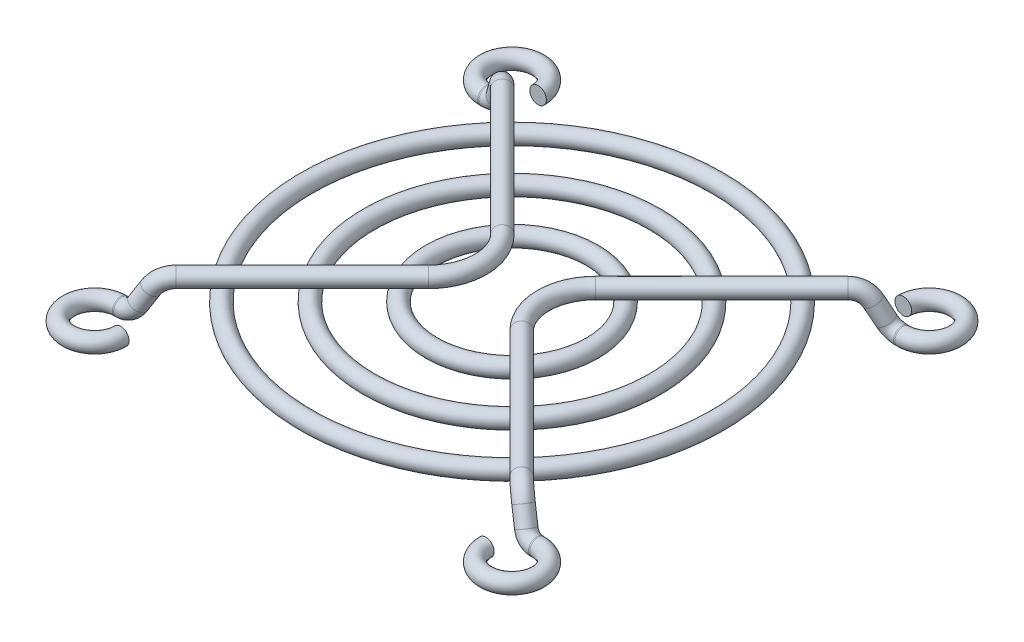
ISO-10303-21;
HEADER;
FILE_DESCRIPTION(('STEP AP214'),'2;1');
FILE_NAME('part.step','',(''),(''),'','','');
FILE_SCHEMA(('AUTOMOTIVE_DESIGN { 1 0 10303 214 1 1 1 1 }'));
ENDSEC;
DATA;
#1=APPLICATION_CONTEXT('core data for automotive mechanical design processes');
#2=APPLICATION_PROTOCOL_DEFINITION('international standard','automotive_design',2000,#1);
#3=PRODUCT_CONTEXT('',#1,'mechanical');
#4=PRODUCT('Part','Part','',(#3));
#5=PRODUCT_RELATED_PRODUCT_CATEGORY('part','',(#4));
#6=PRODUCT_DEFINITION_FORMATION('','',#4);
#7=PRODUCT_DEFINITION_CONTEXT('part definition',#1,'design');
#8=PRODUCT_DEFINITION('design','',#6,#7);
#9=PRODUCT_DEFINITION_SHAPE('','',#8);
#10=(LENGTH_UNIT() NAMED_UNIT(*) SI_UNIT(.MILLI.,.METRE.));
#11=(NAMED_UNIT(*) PLANE_ANGLE_UNIT() SI_UNIT($,.RADIAN.));
#12=(NAMED_UNIT(*) SI_UNIT($,.STERADIAN.) SOLID_ANGLE_UNIT());
#13=UNCERTAINTY_MEASURE_WITH_UNIT(LENGTH_MEASURE(1.E-05),#10,'distance_accuracy_value','');
#14=(GEOMETRIC_REPRESENTATION_CONTEXT(3) GLOBAL_UNCERTAINTY_ASSIGNED_CONTEXT((#13)) GLOBAL_UNIT_ASSIGNED_CONTEXT((#10,
#11,#12)) REPRESENTATION_CONTEXT('',''));
#15=CARTESIAN_POINT('',(0.,0.,0.));
#16=DIRECTION('',(0.,0.,1.));
#17=DIRECTION('',(1.,0.,0.));
#18=AXIS2_PLACEMENT_3D('',#15,#16,#17);
#19=CARTESIAN_POINT('',(20.,-1.6,-20.));
#20=DIRECTION('',(0.,-1.,0.));
#21=DIRECTION('',(0.,0.,-1.));
#22=AXIS2_PLACEMENT_3D('',#19,#20,#21);
#23=TOROIDAL_SURFACE('',#22,2.5,0.799999999999999);
#24=CARTESIAN_POINT('',(17.5,-1.6,-19.9999999999999));
#25=DIRECTION('',(0.,0.,-1.));
#26=DIRECTION('',(-1.,0.,0.));
#27=AXIS2_PLACEMENT_3D('',#24,#25,#26);
#28=CIRCLE('',#27,0.799999999999999);
#29=CARTESIAN_POINT('',(16.7,-1.6,-19.9999999999999));
#30=VERTEX_POINT('',#29);
#31=EDGE_CURVE('E11',#30,#30,#28,.T.);
#32=CARTESIAN_POINT('',(20.,-1.6,-17.5));
#33=DIRECTION('',(-1.,0.,0.));
#34=DIRECTION('',(0.,0.,1.));
#35=AXIS2_PLACEMENT_3D('',#32,#33,#34);
#36=CIRCLE('',#35,0.799999999999999);
#37=CARTESIAN_POINT('',(20.,-1.6,-16.7));
#38=VERTEX_POINT('',#37);
#39=EDGE_CURVE('E49',#38,#38,#36,.T.);
#40=CARTESIAN_POINT('',(20.,-1.6,-20.));
#41=DIRECTION('',(0.,-1.,0.));
#42=DIRECTION('',(0.,0.,-1.));
#43=AXIS2_PLACEMENT_3D('',#40,#41,#42);
#44=CIRCLE('',#43,3.3);
#45=EDGE_CURVE('',#30,#38,#44,.T.);
#46=ORIENTED_EDGE('',*,*,#31,.T.);
#47=ORIENTED_EDGE('',*,*,#39,.F.);
#48=ORIENTED_EDGE('',*,*,#45,.T.);
#49=ORIENTED_EDGE('',*,*,#45,.F.);
#50=EDGE_LOOP('',(#46,#48,#47,#49));
#51=FACE_BOUND('',#50,.T.);
#52=ADVANCED_FACE('F43',(#51),#23,.T.);
#53=CARTESIAN_POINT('',(19.8782443274925,-1.6,-17.5));
#54=DIRECTION('',(1.,0.,0.));
#55=DIRECTION('',(0.,-1.,0.));
#56=AXIS2_PLACEMENT_3D('',#53,#54,#55);
#57=CYLINDRICAL_SURFACE('',#56,0.799999999999999);
#58=CARTESIAN_POINT('',(19.8782443274925,-1.6,-17.5));
#59=DIRECTION('',(-1.,0.,0.));
#60=DIRECTION('',(0.,0.,1.));
#61=AXIS2_PLACEMENT_3D('',#58,#59,#60);
#62=CIRCLE('',#61,0.799999999999999);
#63=CARTESIAN_POINT('',(19.8782443274926,-2.35955153182213,-17.7511602486594));
#64=VERTEX_POINT('',#63);
#65=EDGE_CURVE('E53',#64,#64,#62,.T.);
#66=ORIENTED_EDGE('',*,*,#65,.F.);
#67=EDGE_LOOP('',(#66));
#68=FACE_BOUND('',#67,.T.);
#69=ORIENTED_EDGE('',*,*,#39,.T.);
#70=EDGE_LOOP('',(#69));
#71=FACE_BOUND('',#70,.T.);
#72=ADVANCED_FACE('F111',(#68,#71),#57,.T.);
#73=CARTESIAN_POINT('',(19.8782443274925,-0.270784819311277,-17.060469564846));
#74=DIRECTION('',(0.,0.313950310824273,-0.949439414777658));
#75=DIRECTION('',(0.,0.949439414777658,0.313950310824273));
#76=AXIS2_PLACEMENT_3D('',#73,#74,#75);
#77=TOROIDAL_SURFACE('',#76,1.4,0.799999999999999);
#78=CARTESIAN_POINT('',(18.617781817604,-0.849268726889308,-17.2517563386666));
#79=DIRECTION('',(-0.435207117690506,0.854809134098409,0.282658997687056));
#80=DIRECTION('',(0.282658997687037,-0.168351654670456,0.944331303831595));
#81=AXIS2_PLACEMENT_3D('',#78,#79,#80);
#82=CIRCLE('',#81,0.799999999999999);
#83=CARTESIAN_POINT('',(17.8975175262391,-1.17983095979104,-17.3610630665641));
#84=VERTEX_POINT('',#83);
#85=EDGE_CURVE('E57',#84,#84,#82,.T.);
#86=CARTESIAN_POINT('',(19.8782443274925,-0.270784819311277,-17.060469564846));
#87=DIRECTION('',(0.,0.313950310824273,-0.949439414777658));
#88=DIRECTION('',(0.,0.949439414777658,0.313950310824273));
#89=AXIS2_PLACEMENT_3D('',#86,#87,#88);
#90=CIRCLE('',#89,2.2);
#91=EDGE_CURVE('',#64,#84,#90,.T.);
#92=ORIENTED_EDGE('',*,*,#65,.T.);
#93=ORIENTED_EDGE('',*,*,#85,.F.);
#94=ORIENTED_EDGE('',*,*,#91,.T.);
#95=ORIENTED_EDGE('',*,*,#91,.F.);
#96=EDGE_LOOP('',(#92,#94,#93,#95));
#97=FACE_BOUND('',#96,.T.);
#98=ADVANCED_FACE('F116',(#97),#77,.T.);
#99=CARTESIAN_POINT('',(17.868227009508,0.62296430980344,-16.764934312657));
#100=DIRECTION('',(0.435207117690505,-0.854809134098413,-0.282658997687043));
#101=DIRECTION('',(-0.891149813497044,-0.4537091688562,0.));
#102=AXIS2_PLACEMENT_3D('',#99,#100,#101);
#103=CYLINDRICAL_SURFACE('',#102,0.799999999999999);
#104=CARTESIAN_POINT('',(17.868227009508,0.62296430980344,-16.764934312657));
#105=DIRECTION('',(-0.435207117690506,0.854809134098409,0.282658997687056));
#106=DIRECTION('',(0.282658997687037,-0.168351654670456,0.944331303831595));
#107=AXIS2_PLACEMENT_3D('',#104,#105,#106);
#108=CIRCLE('',#107,0.799999999999999);
#109=CARTESIAN_POINT('',(18.3196651347374,1.02585560697571,-17.2882718918086));
#110=VERTEX_POINT('',#109);
#111=EDGE_CURVE('E62',#110,#110,#108,.T.);
#112=ORIENTED_EDGE('',*,*,#111,.F.);
#113=EDGE_LOOP('',(#112));
#114=FACE_BOUND('',#113,.T.);
#115=ORIENTED_EDGE('',*,*,#85,.T.);
#116=EDGE_LOOP('',(#115));
#117=FACE_BOUND('',#116,.T.);
#118=ADVANCED_FACE('F121',(#114,#117),#103,.T.);
#119=CARTESIAN_POINT('',(16.7396316964346,-0.384263933127242,-15.4565903647781));
#120=DIRECTION('',(0.701543241389085,0.125196489258293,0.701543241389078));
#121=DIRECTION('',(-0.707106781186544,0.,0.707106781186551));
#122=AXIS2_PLACEMENT_3D('',#119,#120,#121);
#123=TOROIDAL_SURFACE('',#122,2.,0.799999999999999);
#124=CARTESIAN_POINT('',(16.562577123364,1.6,-15.6336449378487));
#125=DIRECTION('',(-0.707106781186537,0.,0.707106781186558));
#126=DIRECTION('',(0.637166139093871,-0.433634203430094,0.637166139093846));
#127=AXIS2_PLACEMENT_3D('',#124,#125,#126);
#128=CIRCLE('',#127,0.799999999999999);
#129=CARTESIAN_POINT('',(16.4917552941358,2.39370557325089,-15.7044667670769));
#130=VERTEX_POINT('',#129);
#131=EDGE_CURVE('E65',#130,#130,#128,.T.);
#132=CARTESIAN_POINT('',(16.7396316964346,-0.384263933127242,-15.4565903647781));
#133=DIRECTION('',(0.701543241389085,0.125196489258293,0.701543241389078));
#134=DIRECTION('',(-0.707106781186544,0.,0.707106781186551));
#135=AXIS2_PLACEMENT_3D('',#132,#133,#134);
#136=CIRCLE('',#135,2.8);
#137=EDGE_CURVE('',#110,#130,#136,.T.);
#138=ORIENTED_EDGE('',*,*,#111,.T.);
#139=ORIENTED_EDGE('',*,*,#131,.F.);
#140=ORIENTED_EDGE('',*,*,#137,.T.);
#141=ORIENTED_EDGE('',*,*,#137,.F.);
#142=EDGE_LOOP('',(#138,#140,#139,#141));
#143=FACE_BOUND('',#142,.T.);
#144=ADVANCED_FACE('F128',(#143),#123,.T.);
#145=CARTESIAN_POINT('',(4.46446609275775,1.6,-3.53553390724225));
#146=DIRECTION('',(0.707106781186544,0.,-0.707106781186551));
#147=DIRECTION('',(0.707106781186551,0.,0.707106781186544));
#148=AXIS2_PLACEMENT_3D('',#145,#146,#147);
#149=CYLINDRICAL_SURFACE('',#148,0.799999999999999);
#150=CARTESIAN_POINT('',(4.46446609275775,1.6,-3.53553390724225));
#151=DIRECTION('',(-0.707106781186537,0.,0.707106781186558));
#152=DIRECTION('',(0.637166139093871,-0.433634203430094,0.637166139093846));
#153=AXIS2_PLACEMENT_3D('',#150,#151,#152);
#154=CIRCLE('',#153,0.799999999999999);
#155=CARTESIAN_POINT('',(3.89878066780851,1.6,-4.10121933219149));
#156=VERTEX_POINT('',#155);
#157=EDGE_CURVE('E68',#156,#156,#154,.T.);
#158=ORIENTED_EDGE('',*,*,#157,.F.);
#159=EDGE_LOOP('',(#158));
#160=FACE_BOUND('',#159,.T.);
#161=ORIENTED_EDGE('',*,*,#131,.T.);
#162=EDGE_LOOP('',(#161));
#163=FACE_BOUND('',#162,.T.);
#164=ADVANCED_FACE('F132',(#160,#163),#149,.T.);
#165=CARTESIAN_POINT('',(8.,1.6,0.));
#166=DIRECTION('',(0.,1.,0.));
#167=DIRECTION('',(0.,0.,1.));
#168=AXIS2_PLACEMENT_3D('',#165,#166,#167);
#169=TOROIDAL_SURFACE('',#168,5.00000000185193,0.799999999999999);
#170=CARTESIAN_POINT('',(4.46446609275775,1.6,3.53553390724226));
#171=DIRECTION('',(0.70710678118656,0.,0.707106781186535));
#172=DIRECTION('',(0.637166139093845,-0.433634203430094,-0.637166139093872));
#173=AXIS2_PLACEMENT_3D('',#170,#171,#172);
#174=CIRCLE('',#173,0.799999999999999);
#175=CARTESIAN_POINT('',(3.89878066780852,1.6,4.10121933219149));
#176=VERTEX_POINT('',#175);
#177=EDGE_CURVE('E71',#176,#176,#174,.T.);
#178=CARTESIAN_POINT('',(8.,1.6,0.));
#179=DIRECTION('',(0.,1.,0.));
#180=DIRECTION('',(0.,0.,1.));
#181=AXIS2_PLACEMENT_3D('',#178,#179,#180);
#182=CIRCLE('',#181,5.80000000185193);
#183=EDGE_CURVE('',#156,#176,#182,.T.);
#184=ORIENTED_EDGE('',*,*,#157,.T.);
#185=ORIENTED_EDGE('',*,*,#177,.F.);
#186=ORIENTED_EDGE('',*,*,#183,.T.);
#187=ORIENTED_EDGE('',*,*,#183,.F.);
#188=EDGE_LOOP('',(#184,#186,#185,#187));
#189=FACE_BOUND('',#188,.T.);
#190=ADVANCED_FACE('F136',(#189),#169,.T.);
#191=CARTESIAN_POINT('',(16.5625771233642,1.59999999999999,15.6336449378485));
#192=DIRECTION('',(-0.707106781186553,0.,-0.707106781186542));
#193=DIRECTION('',(0.707106781186542,0.,-0.707106781186553));
#194=AXIS2_PLACEMENT_3D('',#191,#192,#193);
#195=CYLINDRICAL_SURFACE('',#194,0.799999999999999);
#196=CARTESIAN_POINT('',(16.5625771233642,1.59999999999999,15.6336449378485));
#197=DIRECTION('',(0.70710678118656,0.,0.707106781186535));
#198=DIRECTION('',(0.637166139093845,-0.433634203430094,-0.637166139093872));
#199=AXIS2_PLACEMENT_3D('',#196,#197,#198);
#200=CIRCLE('',#199,0.799999999999999);
#201=CARTESIAN_POINT('',(16.491755294136,2.3937055732509,15.7044667670767));
#202=VERTEX_POINT('',#201);
#203=EDGE_CURVE('E74',#202,#202,#200,.T.);
#204=ORIENTED_EDGE('',*,*,#203,.F.);
#205=EDGE_LOOP('',(#204));
#206=FACE_BOUND('',#205,.T.);
#207=ORIENTED_EDGE('',*,*,#177,.T.);
#208=EDGE_LOOP('',(#207));
#209=FACE_BOUND('',#208,.T.);
#210=ADVANCED_FACE('F140',(#206,#209),#195,.T.);
#211=CARTESIAN_POINT('',(16.7396316964347,-0.384263933127265,15.4565903647781));
#212=DIRECTION('',(0.701543241389084,0.125196489258209,-0.701543241389094));
#213=DIRECTION('',(0.707106781186553,0.,0.707106781186542));
#214=AXIS2_PLACEMENT_3D('',#211,#212,#213);
#215=TOROIDAL_SURFACE('',#214,1.99999999999999,0.799999999999999);
#216=CARTESIAN_POINT('',(17.8682270095082,0.622964309803452,16.7649343126569));
#217=DIRECTION('',(0.435207117690451,-0.854809134098433,0.282658997687066));
#218=DIRECTION('',(0.282658997687073,-0.168351654670459,-0.944331303831583));
#219=AXIS2_PLACEMENT_3D('',#216,#217,#218);
#220=CIRCLE('',#219,0.799999999999999);
#221=CARTESIAN_POINT('',(18.3196651347376,1.02585560697574,17.2882718918085));
#222=VERTEX_POINT('',#221);
#223=EDGE_CURVE('E77',#222,#222,#220,.T.);
#224=CARTESIAN_POINT('',(16.7396316964347,-0.384263933127265,15.4565903647781));
#225=DIRECTION('',(0.701543241389084,0.125196489258209,-0.701543241389094));
#226=DIRECTION('',(0.707106781186553,0.,0.707106781186542));
#227=AXIS2_PLACEMENT_3D('',#224,#225,#226);
#228=CIRCLE('',#227,2.79999999999999);
#229=EDGE_CURVE('',#202,#222,#228,.T.);
#230=ORIENTED_EDGE('',*,*,#203,.T.);
#231=ORIENTED_EDGE('',*,*,#223,.F.);
#232=ORIENTED_EDGE('',*,*,#229,.T.);
#233=ORIENTED_EDGE('',*,*,#229,.F.);
#234=EDGE_LOOP('',(#230,#232,#231,#233));
#235=FACE_BOUND('',#234,.T.);
#236=ADVANCED_FACE('F144',(#235),#215,.T.);
#237=CARTESIAN_POINT('',(18.6177818176039,-0.84926872688919,17.2517563386666));
#238=DIRECTION('',(-0.435207117690453,0.854809134098428,-0.28265899768708));
#239=DIRECTION('',(0.891149813497069,0.453709168856151,0.));
#240=AXIS2_PLACEMENT_3D('',#237,#238,#239);
#241=CYLINDRICAL_SURFACE('',#240,0.799999999999999);
#242=CARTESIAN_POINT('',(18.6177818176039,-0.84926872688919,17.2517563386666));
#243=DIRECTION('',(0.435207117690451,-0.854809134098433,0.282658997687066));
#244=DIRECTION('',(0.282658997687073,-0.168351654670459,-0.944331303831583));
#245=AXIS2_PLACEMENT_3D('',#242,#243,#244);
#246=CIRCLE('',#245,0.799999999999999);
#247=CARTESIAN_POINT('',(17.897517526239,-1.17983095979084,17.3610630665641));
#248=VERTEX_POINT('',#247);
#249=EDGE_CURVE('E80',#248,#248,#246,.T.);
#250=ORIENTED_EDGE('',*,*,#249,.F.);
#251=EDGE_LOOP('',(#250));
#252=FACE_BOUND('',#251,.T.);
#253=ORIENTED_EDGE('',*,*,#223,.T.);
#254=EDGE_LOOP('',(#253));
#255=FACE_BOUND('',#254,.T.);
#256=ADVANCED_FACE('F148',(#252,#255),#241,.T.);
#257=CARTESIAN_POINT('',(19.8782443274926,-0.270784819311291,17.060469564846));
#258=DIRECTION('',(0.,0.313950310824303,0.949439414777648));
#259=DIRECTION('',(0.,-0.949439414777648,0.313950310824303));
#260=AXIS2_PLACEMENT_3D('',#257,#258,#259);
#261=TOROIDAL_SURFACE('',#260,1.4,0.799999999999999);
#262=CARTESIAN_POINT('',(19.8782443274925,-1.6,17.5));
#263=DIRECTION('',(1.,0.,0.));
#264=DIRECTION('',(0.,0.,-1.));
#265=AXIS2_PLACEMENT_3D('',#262,#263,#264);
#266=CIRCLE('',#265,0.799999999999999);
#267=CARTESIAN_POINT('',(19.8782443274925,-2.35955153182212,17.7511602486594));
#268=VERTEX_POINT('',#267);
#269=EDGE_CURVE('E83',#268,#268,#266,.T.);
#270=CARTESIAN_POINT('',(19.8782443274926,-0.270784819311291,17.060469564846));
#271=DIRECTION('',(0.,0.313950310824303,0.949439414777648));
#272=DIRECTION('',(0.,-0.949439414777648,0.313950310824303));
#273=AXIS2_PLACEMENT_3D('',#270,#271,#272);
#274=CIRCLE('',#273,2.2);
#275=EDGE_CURVE('',#248,#268,#274,.T.);
#276=ORIENTED_EDGE('',*,*,#249,.T.);
#277=ORIENTED_EDGE('',*,*,#269,.F.);
#278=ORIENTED_EDGE('',*,*,#275,.T.);
#279=ORIENTED_EDGE('',*,*,#275,.F.);
#280=EDGE_LOOP('',(#276,#278,#277,#279));
#281=FACE_BOUND('',#280,.T.);
#282=ADVANCED_FACE('F107',(#281),#261,.T.);
#283=CARTESIAN_POINT('',(20.,-1.6,17.5));
#284=DIRECTION('',(-1.,0.,0.));
#285=DIRECTION('',(0.,1.,0.));
#286=AXIS2_PLACEMENT_3D('',#283,#284,#285);
#287=CYLINDRICAL_SURFACE('',#286,0.799999999999999);
#288=CARTESIAN_POINT('',(20.,-1.6,17.5));
#289=DIRECTION('',(1.,0.,0.));
#290=DIRECTION('',(0.,0.,-1.));
#291=AXIS2_PLACEMENT_3D('',#288,#289,#290);
#292=CIRCLE('',#291,0.799999999999999);
#293=CARTESIAN_POINT('',(20.,-1.6,16.7));
#294=VERTEX_POINT('',#293);
#295=EDGE_CURVE('E86',#294,#294,#292,.T.);
#296=ORIENTED_EDGE('',*,*,#295,.F.);
#297=EDGE_LOOP('',(#296));
#298=FACE_BOUND('',#297,.T.);
#299=ORIENTED_EDGE('',*,*,#269,.T.);
#300=EDGE_LOOP('',(#299));
#301=FACE_BOUND('',#300,.T.);
#302=ADVANCED_FACE('F98',(#298,#301),#287,.T.);
#303=CARTESIAN_POINT('',(20.,-1.6,20.));
#304=DIRECTION('',(0.,1.,0.));
#305=DIRECTION('',(0.,0.,1.));
#306=AXIS2_PLACEMENT_3D('',#303,#304,#305);
#307=TOROIDAL_SURFACE('',#306,2.5,0.799999999999999);
#308=CARTESIAN_POINT('',(17.5,-1.6,20.));
#309=DIRECTION('',(0.,0.,-1.));
#310=DIRECTION('',(-1.,0.,0.));
#311=AXIS2_PLACEMENT_3D('',#308,#309,#310);
#312=CIRCLE('',#311,0.799999999999999);
#313=CARTESIAN_POINT('',(16.7,-1.6,20.));
#314=VERTEX_POINT('',#313);
#315=EDGE_CURVE('E89',#314,#314,#312,.T.);
#316=CARTESIAN_POINT('',(20.,-1.6,20.));
#317=DIRECTION('',(0.,1.,0.));
#318=DIRECTION('',(0.,0.,1.));
#319=AXIS2_PLACEMENT_3D('',#316,#317,#318);
#320=CIRCLE('',#319,3.29999999999999);
#321=EDGE_CURVE('',#314,#294,#320,.T.);
#322=ORIENTED_EDGE('',*,*,#315,.F.);
#323=ORIENTED_EDGE('',*,*,#295,.T.);
#324=ORIENTED_EDGE('',*,*,#321,.T.);
#325=ORIENTED_EDGE('',*,*,#321,.F.);
#326=EDGE_LOOP('',(#322,#324,#323,#325));
#327=FACE_BOUND('',#326,.T.);
#328=ADVANCED_FACE('F95',(#327),#307,.T.);
#329=CARTESIAN_POINT('',(17.5,-1.6,-19.9999999999999));
#330=DIRECTION('',(0.,0.,1.));
#331=DIRECTION('',(-1.,0.,0.));
#332=AXIS2_PLACEMENT_3D('',#329,#330,#331);
#333=PLANE('',#332);
#334=ORIENTED_EDGE('',*,*,#31,.F.);
#335=EDGE_LOOP('',(#334));
#336=FACE_BOUND('',#335,.T.);
#337=ADVANCED_FACE('F97',(#336),#333,.T.);
#338=CARTESIAN_POINT('',(17.5,-1.6,20.));
#339=DIRECTION('',(0.,0.,1.));
#340=DIRECTION('',(-1.,0.,0.));
#341=AXIS2_PLACEMENT_3D('',#338,#339,#340);
#342=PLANE('',#341);
#343=ORIENTED_EDGE('',*,*,#315,.T.);
#344=EDGE_LOOP('',(#343));
#345=FACE_BOUND('',#344,.T.);
#346=ADVANCED_FACE('F93',(#345),#342,.F.);
#347=CLOSED_SHELL('',(#52,#72,#98,#118,#144,#164,#190,#210,#236,#256,#282,#302,#328,#337,#346));
#348=MANIFOLD_SOLID_BREP('B2',#347);
#349=CARTESIAN_POINT('',(-20.,-1.6,-20.));
#350=DIRECTION('',(0.,-1.,0.));
#351=DIRECTION('',(0.,0.,-1.));
#352=AXIS2_PLACEMENT_3D('',#349,#350,#351);
#353=TOROIDAL_SURFACE('',#352,2.5,0.799999999999999);
#354=CARTESIAN_POINT('',(-20.,-1.6,-17.5));
#355=DIRECTION('',(-1.,0.,0.));
#356=DIRECTION('',(0.,0.,1.));
#357=AXIS2_PLACEMENT_3D('',#354,#355,#356);
#358=CIRCLE('',#357,0.799999999999999);
#359=CARTESIAN_POINT('',(-20.,-1.6,-16.7));
#360=VERTEX_POINT('',#359);
#361=EDGE_CURVE('E275',#360,#360,#358,.T.);
#362=CARTESIAN_POINT('',(-17.5,-1.6,-19.9999999999999));
#363=DIRECTION('',(0.,0.,1.));
#364=DIRECTION('',(1.,0.,0.));
#365=AXIS2_PLACEMENT_3D('',#362,#363,#364);
#366=CIRCLE('',#365,0.799999999999999);
#367=CARTESIAN_POINT('',(-16.7,-1.6,-19.9999999999999));
#368=VERTEX_POINT('',#367);
#369=EDGE_CURVE('E42',#368,#368,#366,.T.);
#370=CARTESIAN_POINT('',(-20.,-1.6,-20.));
#371=DIRECTION('',(0.,-1.,0.));
#372=DIRECTION('',(0.,0.,-1.));
#373=AXIS2_PLACEMENT_3D('',#370,#371,#372);
#374=CIRCLE('',#373,3.3);
#375=EDGE_CURVE('',#360,#368,#374,.T.);
#376=ORIENTED_EDGE('',*,*,#361,.T.);
#377=ORIENTED_EDGE('',*,*,#369,.F.);
#378=ORIENTED_EDGE('',*,*,#375,.T.);
#379=ORIENTED_EDGE('',*,*,#375,.F.);
#380=EDGE_LOOP('',(#376,#378,#377,#379));
#381=FACE_BOUND('',#380,.T.);
#382=ADVANCED_FACE('F269',(#381),#353,.T.);
#383=CARTESIAN_POINT('',(-19.8782443274925,-1.6,-17.5));
#384=DIRECTION('',(-1.,0.,0.));
#385=DIRECTION('',(0.,-1.,0.));
#386=AXIS2_PLACEMENT_3D('',#383,#384,#385);
#387=CYLINDRICAL_SURFACE('',#386,0.799999999999999);
#388=CARTESIAN_POINT('',(-19.8782443274925,-1.6,-17.5));
#389=DIRECTION('',(-1.,0.,0.));
#390=DIRECTION('',(0.,0.,1.));
#391=AXIS2_PLACEMENT_3D('',#388,#389,#390);
#392=CIRCLE('',#391,0.799999999999999);
#393=CARTESIAN_POINT('',(-19.8782443274926,-2.35955153182213,-17.7511602486594));
#394=VERTEX_POINT('',#393);
#395=EDGE_CURVE('E279',#394,#394,#392,.T.);
#396=ORIENTED_EDGE('',*,*,#395,.T.);
#397=EDGE_LOOP('',(#396));
#398=FACE_BOUND('',#397,.T.);
#399=ORIENTED_EDGE('',*,*,#361,.F.);
#400=EDGE_LOOP('',(#399));
#401=FACE_BOUND('',#400,.T.);
#402=ADVANCED_FACE('F330',(#398,#401),#387,.T.);
#403=CARTESIAN_POINT('',(-19.8782443274925,-0.270784819311277,-17.060469564846));
#404=DIRECTION('',(0.,0.313950310824273,-0.949439414777658));
#405=DIRECTION('',(0.,0.949439414777658,0.313950310824273));
#406=AXIS2_PLACEMENT_3D('',#403,#404,#405);
#407=TOROIDAL_SURFACE('',#406,1.4,0.799999999999999);
#408=CARTESIAN_POINT('',(-18.617781817604,-0.849268726889308,-17.2517563386666));
#409=DIRECTION('',(-0.435207117690506,-0.854809134098409,-0.282658997687056));
#410=DIRECTION('',(-0.282658997687037,-0.168351654670456,0.944331303831595));
#411=AXIS2_PLACEMENT_3D('',#408,#409,#410);
#412=CIRCLE('',#411,0.799999999999999);
#413=CARTESIAN_POINT('',(-17.8975175262391,-1.17983095979104,-17.3610630665641));
#414=VERTEX_POINT('',#413);
#415=EDGE_CURVE('E283',#414,#414,#412,.T.);
#416=CARTESIAN_POINT('',(-19.8782443274925,-0.270784819311277,-17.060469564846));
#417=DIRECTION('',(0.,0.313950310824273,-0.949439414777658));
#418=DIRECTION('',(0.,0.949439414777658,0.313950310824273));
#419=AXIS2_PLACEMENT_3D('',#416,#417,#418);
#420=CIRCLE('',#419,2.2);
#421=EDGE_CURVE('',#414,#394,#420,.T.);
#422=ORIENTED_EDGE('',*,*,#415,.T.);
#423=ORIENTED_EDGE('',*,*,#395,.F.);
#424=ORIENTED_EDGE('',*,*,#421,.T.);
#425=ORIENTED_EDGE('',*,*,#421,.F.);
#426=EDGE_LOOP('',(#422,#424,#423,#425));
#427=FACE_BOUND('',#426,.T.);
#428=ADVANCED_FACE('F334',(#427),#407,.T.);
#429=CARTESIAN_POINT('',(-17.868227009508,0.62296430980344,-16.764934312657));
#430=DIRECTION('',(-0.435207117690505,-0.854809134098413,-0.282658997687043));
#431=DIRECTION('',(0.891149813497044,-0.4537091688562,0.));
#432=AXIS2_PLACEMENT_3D('',#429,#430,#431);
#433=CYLINDRICAL_SURFACE('',#432,0.799999999999999);
#434=CARTESIAN_POINT('',(-17.868227009508,0.62296430980344,-16.764934312657));
#435=DIRECTION('',(-0.435207117690506,-0.854809134098409,-0.282658997687056));
#436=DIRECTION('',(-0.282658997687037,-0.168351654670456,0.944331303831595));
#437=AXIS2_PLACEMENT_3D('',#434,#435,#436);
#438=CIRCLE('',#437,0.799999999999999);
#439=CARTESIAN_POINT('',(-18.3196651347374,1.02585560697571,-17.2882718918086));
#440=VERTEX_POINT('',#439);
#441=EDGE_CURVE('E288',#440,#440,#438,.T.);
#442=ORIENTED_EDGE('',*,*,#441,.T.);
#443=EDGE_LOOP('',(#442));
#444=FACE_BOUND('',#443,.T.);
#445=ORIENTED_EDGE('',*,*,#415,.F.);
#446=EDGE_LOOP('',(#445));
#447=FACE_BOUND('',#446,.T.);
#448=ADVANCED_FACE('F340',(#444,#447),#433,.T.);
#449=CARTESIAN_POINT('',(-16.7396316964346,-0.384263933127242,-15.4565903647781));
#450=DIRECTION('',(-0.701543241389085,0.125196489258293,0.701543241389078));
#451=DIRECTION('',(0.707106781186544,0.,0.707106781186551));
#452=AXIS2_PLACEMENT_3D('',#449,#450,#451);
#453=TOROIDAL_SURFACE('',#452,2.,0.799999999999999);
#454=CARTESIAN_POINT('',(-16.562577123364,1.6,-15.6336449378487));
#455=DIRECTION('',(-0.707106781186537,0.,-0.707106781186558));
#456=DIRECTION('',(-0.637166139093871,-0.433634203430094,0.637166139093846));
#457=AXIS2_PLACEMENT_3D('',#454,#455,#456);
#458=CIRCLE('',#457,0.799999999999999);
#459=CARTESIAN_POINT('',(-16.4917552941358,2.39370557325089,-15.7044667670769));
#460=VERTEX_POINT('',#459);
#461=EDGE_CURVE('E291',#460,#460,#458,.T.);
#462=CARTESIAN_POINT('',(-16.7396316964346,-0.384263933127242,-15.4565903647781));
#463=DIRECTION('',(-0.701543241389085,0.125196489258293,0.701543241389078));
#464=DIRECTION('',(0.707106781186544,0.,0.707106781186551));
#465=AXIS2_PLACEMENT_3D('',#462,#463,#464);
#466=CIRCLE('',#465,2.8);
#467=EDGE_CURVE('',#460,#440,#466,.T.);
#468=ORIENTED_EDGE('',*,*,#461,.T.);
#469=ORIENTED_EDGE('',*,*,#441,.F.);
#470=ORIENTED_EDGE('',*,*,#467,.T.);
#471=ORIENTED_EDGE('',*,*,#467,.F.);
#472=EDGE_LOOP('',(#468,#470,#469,#471));
#473=FACE_BOUND('',#472,.T.);
#474=ADVANCED_FACE('F347',(#473),#453,.T.);
#475=CARTESIAN_POINT('',(-4.46446609275775,1.6,-3.53553390724225));
#476=DIRECTION('',(-0.707106781186544,0.,-0.707106781186551));
#477=DIRECTION('',(-0.707106781186551,0.,0.707106781186544));
#478=AXIS2_PLACEMENT_3D('',#475,#476,#477);
#479=CYLINDRICAL_SURFACE('',#478,0.799999999999999);
#480=CARTESIAN_POINT('',(-4.46446609275775,1.6,-3.53553390724225));
#481=DIRECTION('',(-0.707106781186537,0.,-0.707106781186558));
#482=DIRECTION('',(-0.637166139093871,-0.433634203430094,0.637166139093846));
#483=AXIS2_PLACEMENT_3D('',#480,#481,#482);
#484=CIRCLE('',#483,0.799999999999999);
#485=CARTESIAN_POINT('',(-3.89878066780851,1.6,-4.10121933219149));
#486=VERTEX_POINT('',#485);
#487=EDGE_CURVE('E294',#486,#486,#484,.T.);
#488=ORIENTED_EDGE('',*,*,#487,.T.);
#489=EDGE_LOOP('',(#488));
#490=FACE_BOUND('',#489,.T.);
#491=ORIENTED_EDGE('',*,*,#461,.F.);
#492=EDGE_LOOP('',(#491));
#493=FACE_BOUND('',#492,.T.);
#494=ADVANCED_FACE('F351',(#490,#493),#479,.T.);
#495=CARTESIAN_POINT('',(-8.,1.6,0.));
#496=DIRECTION('',(0.,1.,0.));
#497=DIRECTION('',(0.,0.,1.));
#498=AXIS2_PLACEMENT_3D('',#495,#496,#497);
#499=TOROIDAL_SURFACE('',#498,5.00000000185193,0.799999999999999);
#500=CARTESIAN_POINT('',(-4.46446609275775,1.6,3.53553390724226));
#501=DIRECTION('',(0.70710678118656,0.,-0.707106781186535));
#502=DIRECTION('',(-0.637166139093845,-0.433634203430094,-0.637166139093872));
#503=AXIS2_PLACEMENT_3D('',#500,#501,#502);
#504=CIRCLE('',#503,0.799999999999999);
#505=CARTESIAN_POINT('',(-3.89878066780852,1.6,4.10121933219149));
#506=VERTEX_POINT('',#505);
#507=EDGE_CURVE('E297',#506,#506,#504,.T.);
#508=CARTESIAN_POINT('',(-8.,1.6,0.));
#509=DIRECTION('',(0.,1.,0.));
#510=DIRECTION('',(0.,0.,1.));
#511=AXIS2_PLACEMENT_3D('',#508,#509,#510);
#512=CIRCLE('',#511,5.80000000185193);
#513=EDGE_CURVE('',#506,#486,#512,.T.);
#514=ORIENTED_EDGE('',*,*,#507,.T.);
#515=ORIENTED_EDGE('',*,*,#487,.F.);
#516=ORIENTED_EDGE('',*,*,#513,.T.);
#517=ORIENTED_EDGE('',*,*,#513,.F.);
#518=EDGE_LOOP('',(#514,#516,#515,#517));
#519=FACE_BOUND('',#518,.T.);
#520=ADVANCED_FACE('F355',(#519),#499,.T.);
#521=CARTESIAN_POINT('',(-16.5625771233642,1.59999999999999,15.6336449378485));
#522=DIRECTION('',(0.707106781186553,0.,-0.707106781186542));
#523=DIRECTION('',(-0.707106781186542,0.,-0.707106781186553));
#524=AXIS2_PLACEMENT_3D('',#521,#522,#523);
#525=CYLINDRICAL_SURFACE('',#524,0.799999999999999);
#526=CARTESIAN_POINT('',(-16.5625771233642,1.59999999999999,15.6336449378485));
#527=DIRECTION('',(0.70710678118656,0.,-0.707106781186535));
#528=DIRECTION('',(-0.637166139093845,-0.433634203430094,-0.637166139093872));
#529=AXIS2_PLACEMENT_3D('',#526,#527,#528);
#530=CIRCLE('',#529,0.799999999999999);
#531=CARTESIAN_POINT('',(-16.491755294136,2.3937055732509,15.7044667670767));
#532=VERTEX_POINT('',#531);
#533=EDGE_CURVE('E300',#532,#532,#530,.T.);
#534=ORIENTED_EDGE('',*,*,#533,.T.);
#535=EDGE_LOOP('',(#534));
#536=FACE_BOUND('',#535,.T.);
#537=ORIENTED_EDGE('',*,*,#507,.F.);
#538=EDGE_LOOP('',(#537));
#539=FACE_BOUND('',#538,.T.);
#540=ADVANCED_FACE('F359',(#536,#539),#525,.T.);
#541=CARTESIAN_POINT('',(-16.7396316964347,-0.384263933127265,15.4565903647781));
#542=DIRECTION('',(-0.701543241389084,0.125196489258209,-0.701543241389094));
#543=DIRECTION('',(-0.707106781186553,0.,0.707106781186542));
#544=AXIS2_PLACEMENT_3D('',#541,#542,#543);
#545=TOROIDAL_SURFACE('',#544,1.99999999999999,0.799999999999999);
#546=CARTESIAN_POINT('',(-17.8682270095082,0.622964309803452,16.7649343126569));
#547=DIRECTION('',(0.435207117690451,0.854809134098433,-0.282658997687066));
#548=DIRECTION('',(-0.282658997687073,-0.168351654670459,-0.944331303831583));
#549=AXIS2_PLACEMENT_3D('',#546,#547,#548);
#550=CIRCLE('',#549,0.799999999999999);
#551=CARTESIAN_POINT('',(-18.3196651347376,1.02585560697574,17.2882718918085));
#552=VERTEX_POINT('',#551);
#553=EDGE_CURVE('E303',#552,#552,#550,.T.);
#554=CARTESIAN_POINT('',(-16.7396316964347,-0.384263933127265,15.4565903647781));
#555=DIRECTION('',(-0.701543241389084,0.125196489258209,-0.701543241389094));
#556=DIRECTION('',(-0.707106781186553,0.,0.707106781186542));
#557=AXIS2_PLACEMENT_3D('',#554,#555,#556);
#558=CIRCLE('',#557,2.79999999999999);
#559=EDGE_CURVE('',#552,#532,#558,.T.);
#560=ORIENTED_EDGE('',*,*,#553,.T.);
#561=ORIENTED_EDGE('',*,*,#533,.F.);
#562=ORIENTED_EDGE('',*,*,#559,.T.);
#563=ORIENTED_EDGE('',*,*,#559,.F.);
#564=EDGE_LOOP('',(#560,#562,#561,#563));
#565=FACE_BOUND('',#564,.T.);
#566=ADVANCED_FACE('F363',(#565),#545,.T.);
#567=CARTESIAN_POINT('',(-18.6177818176039,-0.84926872688919,17.2517563386666));
#568=DIRECTION('',(0.435207117690453,0.854809134098428,-0.28265899768708));
#569=DIRECTION('',(-0.891149813497069,0.453709168856151,0.));
#570=AXIS2_PLACEMENT_3D('',#567,#568,#569);
#571=CYLINDRICAL_SURFACE('',#570,0.799999999999999);
#572=CARTESIAN_POINT('',(-18.6177818176039,-0.84926872688919,17.2517563386666));
#573=DIRECTION('',(0.435207117690451,0.854809134098433,-0.282658997687066));
#574=DIRECTION('',(-0.282658997687073,-0.168351654670459,-0.944331303831583));
#575=AXIS2_PLACEMENT_3D('',#572,#573,#574);
#576=CIRCLE('',#575,0.799999999999999);
#577=CARTESIAN_POINT('',(-17.897517526239,-1.17983095979084,17.3610630665641));
#578=VERTEX_POINT('',#577);
#579=EDGE_CURVE('E306',#578,#578,#576,.T.);
#580=ORIENTED_EDGE('',*,*,#579,.T.);
#581=EDGE_LOOP('',(#580));
#582=FACE_BOUND('',#581,.T.);
#583=ORIENTED_EDGE('',*,*,#553,.F.);
#584=EDGE_LOOP('',(#583));
#585=FACE_BOUND('',#584,.T.);
#586=ADVANCED_FACE('F367',(#582,#585),#571,.T.);
#587=CARTESIAN_POINT('',(-19.8782443274926,-0.270784819311291,17.060469564846));
#588=DIRECTION('',(0.,0.313950310824303,0.949439414777648));
#589=DIRECTION('',(0.,-0.949439414777648,0.313950310824303));
#590=AXIS2_PLACEMENT_3D('',#587,#588,#589);
#591=TOROIDAL_SURFACE('',#590,1.4,0.799999999999999);
#592=CARTESIAN_POINT('',(-19.8782443274925,-1.6,17.5));
#593=DIRECTION('',(1.,0.,0.));
#594=DIRECTION('',(0.,0.,-1.));
#595=AXIS2_PLACEMENT_3D('',#592,#593,#594);
#596=CIRCLE('',#595,0.799999999999999);
#597=CARTESIAN_POINT('',(-19.8782443274925,-2.35955153182212,17.7511602486594));
#598=VERTEX_POINT('',#597);
#599=EDGE_CURVE('E309',#598,#598,#596,.T.);
#600=CARTESIAN_POINT('',(-19.8782443274926,-0.270784819311291,17.060469564846));
#601=DIRECTION('',(0.,0.313950310824303,0.949439414777648));
#602=DIRECTION('',(0.,-0.949439414777648,0.313950310824303));
#603=AXIS2_PLACEMENT_3D('',#600,#601,#602);
#604=CIRCLE('',#603,2.2);
#605=EDGE_CURVE('',#598,#578,#604,.T.);
#606=ORIENTED_EDGE('',*,*,#599,.T.);
#607=ORIENTED_EDGE('',*,*,#579,.F.);
#608=ORIENTED_EDGE('',*,*,#605,.T.);
#609=ORIENTED_EDGE('',*,*,#605,.F.);
#610=EDGE_LOOP('',(#606,#608,#607,#609));
#611=FACE_BOUND('',#610,.T.);
#612=ADVANCED_FACE('F371',(#611),#591,.T.);
#613=CARTESIAN_POINT('',(-20.,-1.6,17.5));
#614=DIRECTION('',(1.,0.,0.));
#615=DIRECTION('',(0.,1.,0.));
#616=AXIS2_PLACEMENT_3D('',#613,#614,#615);
#617=CYLINDRICAL_SURFACE('',#616,0.799999999999999);
#618=CARTESIAN_POINT('',(-20.,-1.6,17.5));
#619=DIRECTION('',(1.,0.,0.));
#620=DIRECTION('',(0.,0.,-1.));
#621=AXIS2_PLACEMENT_3D('',#618,#619,#620);
#622=CIRCLE('',#621,0.799999999999999);
#623=CARTESIAN_POINT('',(-20.,-1.6,16.7));
#624=VERTEX_POINT('',#623);
#625=EDGE_CURVE('E312',#624,#624,#622,.T.);
#626=ORIENTED_EDGE('',*,*,#625,.T.);
#627=EDGE_LOOP('',(#626));
#628=FACE_BOUND('',#627,.T.);
#629=ORIENTED_EDGE('',*,*,#599,.F.);
#630=EDGE_LOOP('',(#629));
#631=FACE_BOUND('',#630,.T.);
#632=ADVANCED_FACE('F375',(#628,#631),#617,.T.);
#633=CARTESIAN_POINT('',(-20.,-1.6,20.));
#634=DIRECTION('',(0.,1.,0.));
#635=DIRECTION('',(0.,0.,1.));
#636=AXIS2_PLACEMENT_3D('',#633,#634,#635);
#637=TOROIDAL_SURFACE('',#636,2.5,0.799999999999999);
#638=CARTESIAN_POINT('',(-17.5,-1.6,20.));
#639=DIRECTION('',(0.,0.,1.));
#640=DIRECTION('',(1.,0.,0.));
#641=AXIS2_PLACEMENT_3D('',#638,#639,#640);
#642=CIRCLE('',#641,0.799999999999999);
#643=CARTESIAN_POINT('',(-16.7,-1.6,20.));
#644=VERTEX_POINT('',#643);
#645=EDGE_CURVE('E315',#644,#644,#642,.T.);
#646=CARTESIAN_POINT('',(-20.,-1.6,20.));
#647=DIRECTION('',(0.,1.,0.));
#648=DIRECTION('',(0.,0.,1.));
#649=AXIS2_PLACEMENT_3D('',#646,#647,#648);
#650=CIRCLE('',#649,3.29999999999999);
#651=EDGE_CURVE('',#624,#644,#650,.T.);
#652=ORIENTED_EDGE('',*,*,#625,.F.);
#653=ORIENTED_EDGE('',*,*,#645,.T.);
#654=ORIENTED_EDGE('',*,*,#651,.T.);
#655=ORIENTED_EDGE('',*,*,#651,.F.);
#656=EDGE_LOOP('',(#652,#654,#653,#655));
#657=FACE_BOUND('',#656,.T.);
#658=ADVANCED_FACE('F319',(#657),#637,.T.);
#659=CARTESIAN_POINT('',(-17.5,-1.6,-19.9999999999999));
#660=DIRECTION('',(0.,0.,1.));
#661=DIRECTION('',(1.,0.,0.));
#662=AXIS2_PLACEMENT_3D('',#659,#660,#661);
#663=PLANE('',#662);
#664=ORIENTED_EDGE('',*,*,#369,.T.);
#665=EDGE_LOOP('',(#664));
#666=FACE_BOUND('',#665,.T.);
#667=ADVANCED_FACE('F323',(#666),#663,.T.);
#668=CARTESIAN_POINT('',(-17.5,-1.6,20.));
#669=DIRECTION('',(0.,0.,1.));
#670=DIRECTION('',(1.,0.,0.));
#671=AXIS2_PLACEMENT_3D('',#668,#669,#670);
#672=PLANE('',#671);
#673=ORIENTED_EDGE('',*,*,#645,.F.);
#674=EDGE_LOOP('',(#673));
#675=FACE_BOUND('',#674,.T.);
#676=ADVANCED_FACE('F321',(#675),#672,.F.);
#677=CLOSED_SHELL('',(#382,#402,#428,#448,#474,#494,#520,#540,#566,#586,#612,#632,#658,#667,#676));
#678=MANIFOLD_SOLID_BREP('B6',#677);
#679=CARTESIAN_POINT('',(0.,0.,0.));
#680=DIRECTION('',(0.,-1.,0.));
#681=DIRECTION('',(0.,0.,-1.));
#682=AXIS2_PLACEMENT_3D('',#679,#680,#681);
#683=TOROIDAL_SURFACE('',#682,7.7,0.800000000000001);
#684=CARTESIAN_POINT('',(0.,0.,-8.5));
#685=VERTEX_POINT('',#684);
#686=VERTEX_LOOP('',#685);
#687=FACE_BOUND('',#686,.T.);
#688=ADVANCED_FACE('F495',(#687),#683,.T.);
#689=CLOSED_SHELL('',(#688));
#690=MANIFOLD_SOLID_BREP('B37',#689);
#691=CARTESIAN_POINT('',(0.,0.,0.));
#692=DIRECTION('',(0.,-1.,0.));
#693=DIRECTION('',(0.,0.,-1.));
#694=AXIS2_PLACEMENT_3D('',#691,#692,#693);
#695=TOROIDAL_SURFACE('',#694,13.7,0.800000000000001);
#696=CARTESIAN_POINT('',(0.,0.,-14.5));
#697=VERTEX_POINT('',#696);
#698=VERTEX_LOOP('',#697);
#699=FACE_BOUND('',#698,.T.);
#700=ADVANCED_FACE('F512',(#699),#695,.T.);
#701=CLOSED_SHELL('',(#700));
#702=MANIFOLD_SOLID_BREP('B265',#701);
#703=CARTESIAN_POINT('',(0.,0.,0.));
#704=DIRECTION('',(0.,-1.,0.));
#705=DIRECTION('',(0.,0.,-1.));
#706=AXIS2_PLACEMENT_3D('',#703,#704,#705);
#707=TOROIDAL_SURFACE('',#706,19.7,0.799999999999999);
#708=CARTESIAN_POINT('',(0.,0.,-20.5));
#709=VERTEX_POINT('',#708);
#710=VERTEX_LOOP('',#709);
#711=FACE_BOUND('',#710,.T.);
#712=ADVANCED_FACE('F524',(#711),#707,.T.);
#713=CLOSED_SHELL('',(#712));
#714=MANIFOLD_SOLID_BREP('B491',#713);
#715=ADVANCED_BREP_SHAPE_REPRESENTATION('',(#18,#348,#678,#690,#702,#714),#14);
#716=SHAPE_DEFINITION_REPRESENTATION(#9,#715);
ENDSEC;
END-ISO-10303-21;
